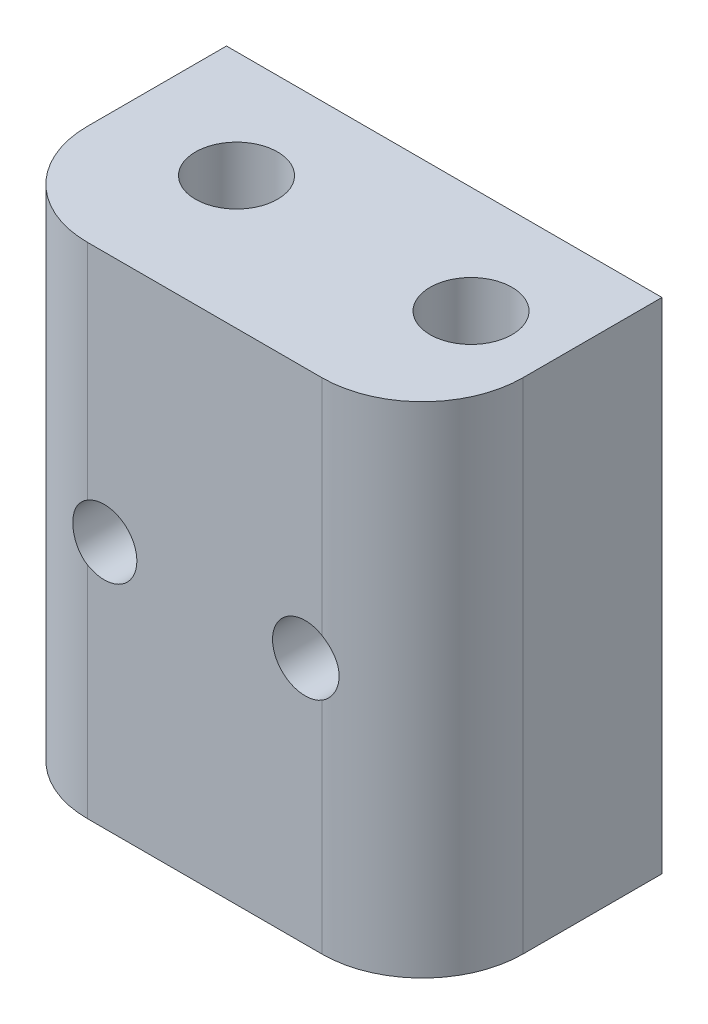
ISO-10303-21;
HEADER;
FILE_DESCRIPTION(('STEP AP214'),'2;1');
FILE_NAME('part.step','',(''),(''),'','','');
FILE_SCHEMA(('AUTOMOTIVE_DESIGN { 1 0 10303 214 1 1 1 1 }'));
ENDSEC;
DATA;
#1=APPLICATION_CONTEXT('core data for automotive mechanical design processes');
#2=APPLICATION_PROTOCOL_DEFINITION('international standard','automotive_design',2000,#1);
#3=PRODUCT_CONTEXT('',#1,'mechanical');
#4=PRODUCT('Part','Part','',(#3));
#5=PRODUCT_RELATED_PRODUCT_CATEGORY('part','',(#4));
#6=PRODUCT_DEFINITION_FORMATION('','',#4);
#7=PRODUCT_DEFINITION_CONTEXT('part definition',#1,'design');
#8=PRODUCT_DEFINITION('design','',#6,#7);
#9=PRODUCT_DEFINITION_SHAPE('','',#8);
#10=(LENGTH_UNIT() NAMED_UNIT(*) SI_UNIT(.MILLI.,.METRE.));
#11=(NAMED_UNIT(*) PLANE_ANGLE_UNIT() SI_UNIT($,.RADIAN.));
#12=(NAMED_UNIT(*) SI_UNIT($,.STERADIAN.) SOLID_ANGLE_UNIT());
#13=UNCERTAINTY_MEASURE_WITH_UNIT(LENGTH_MEASURE(1.E-05),#10,'distance_accuracy_value','');
#14=(GEOMETRIC_REPRESENTATION_CONTEXT(3) GLOBAL_UNCERTAINTY_ASSIGNED_CONTEXT((#13)) GLOBAL_UNIT_ASSIGNED_CONTEXT((#10,
#11,#12)) REPRESENTATION_CONTEXT('',''));
#15=CARTESIAN_POINT('',(0.,0.,0.));
#16=DIRECTION('',(0.,0.,1.));
#17=DIRECTION('',(1.,0.,0.));
#18=AXIS2_PLACEMENT_3D('',#15,#16,#17);
#19=CARTESIAN_POINT('',(-13.1453049350976,13.6204306214154,14.3));
#20=DIRECTION('',(1.,0.,0.));
#21=DIRECTION('',(0.,1.,0.));
#22=AXIS2_PLACEMENT_3D('',#19,#20,#21);
#23=PLANE('',#22);
#24=DIRECTION('',(0.,0.,-1.));
#25=VECTOR('',#24,1.);
#26=CARTESIAN_POINT('',(-13.1453049350976,-16.1795693785846,14.3));
#27=LINE('',#26,#25);
#28=CARTESIAN_POINT('',(-13.1453049350976,-16.1795693785846,8.3));
#29=VERTEX_POINT('',#28);
#30=CARTESIAN_POINT('',(-13.1453049350976,-16.1795693785846,0.));
#31=VERTEX_POINT('',#30);
#32=EDGE_CURVE('E118',#29,#31,#27,.T.);
#33=ORIENTED_EDGE('',*,*,#32,.F.);
#34=DIRECTION('',(0.,-1.,0.));
#35=VECTOR('',#34,1.);
#36=CARTESIAN_POINT('',(-13.1453049350976,13.6204306214154,8.3));
#37=LINE('',#36,#35);
#38=CARTESIAN_POINT('',(-13.1453049350976,13.6204306214154,8.3));
#39=VERTEX_POINT('',#38);
#40=EDGE_CURVE('E132',#29,#39,#37,.F.);
#41=ORIENTED_EDGE('',*,*,#40,.T.);
#42=DIRECTION('',(0.,0.,-1.));
#43=VECTOR('',#42,1.);
#44=CARTESIAN_POINT('',(-13.1453049350976,13.6204306214154,14.3));
#45=LINE('',#44,#43);
#46=CARTESIAN_POINT('',(-13.1453049350976,13.6204306214154,0.));
#47=VERTEX_POINT('',#46);
#48=EDGE_CURVE('E221',#39,#47,#45,.T.);
#49=ORIENTED_EDGE('',*,*,#48,.T.);
#50=DIRECTION('',(0.,-1.,0.));
#51=VECTOR('',#50,1.);
#52=CARTESIAN_POINT('',(-13.1453049350976,13.6204306214154,0.));
#53=LINE('',#52,#51);
#54=EDGE_CURVE('E212',#47,#31,#53,.T.);
#55=ORIENTED_EDGE('',*,*,#54,.T.);
#56=EDGE_LOOP('',(#33,#41,#49,#55));
#57=FACE_BOUND('',#56,.T.);
#58=ADVANCED_FACE('F30',(#57),#23,.F.);
#59=CARTESIAN_POINT('',(-13.1453049350976,-16.1795693785846,14.3));
#60=DIRECTION('',(0.,1.,0.));
#61=DIRECTION('',(0.,0.,1.));
#62=AXIS2_PLACEMENT_3D('',#59,#60,#61);
#63=PLANE('',#62);
#64=CARTESIAN_POINT('',(-6.14530493509756,-16.1795693785846,6.4));
#65=DIRECTION('',(0.,1.,0.));
#66=DIRECTION('',(0.,0.,1.));
#67=AXIS2_PLACEMENT_3D('',#64,#65,#66);
#68=CIRCLE('',#67,2.45);
#69=CARTESIAN_POINT('',(-6.14530493509756,-16.1795693785846,8.85));
#70=VERTEX_POINT('',#69);
#71=EDGE_CURVE('E164',#70,#70,#68,.T.);
#72=ORIENTED_EDGE('',*,*,#71,.T.);
#73=EDGE_LOOP('',(#72));
#74=FACE_BOUND('',#73,.T.);
#75=CARTESIAN_POINT('',(7.85469506492416,-16.1795693785846,6.40000020034491));
#76=DIRECTION('',(0.,1.,0.));
#77=DIRECTION('',(0.,0.,1.));
#78=AXIS2_PLACEMENT_3D('',#75,#76,#77);
#79=CIRCLE('',#78,2.45);
#80=CARTESIAN_POINT('',(7.85469506492416,-16.1795693785846,8.85000020034491));
#81=VERTEX_POINT('',#80);
#82=EDGE_CURVE('E206',#81,#81,#79,.T.);
#83=ORIENTED_EDGE('',*,*,#82,.T.);
#84=EDGE_LOOP('',(#83));
#85=FACE_BOUND('',#84,.T.);
#86=DIRECTION('',(1.,0.,0.));
#87=VECTOR('',#86,1.);
#88=CARTESIAN_POINT('',(-13.1453049350976,-16.1795693785846,14.3));
#89=LINE('',#88,#87);
#90=CARTESIAN_POINT('',(-7.14530493509755,-16.1795693785846,14.3));
#91=VERTEX_POINT('',#90);
#92=CARTESIAN_POINT('',(6.85469506490244,-16.1795693785846,14.3));
#93=VERTEX_POINT('',#92);
#94=EDGE_CURVE('E216',#91,#93,#89,.T.);
#95=ORIENTED_EDGE('',*,*,#94,.F.);
#96=CARTESIAN_POINT('',(-7.14530493509755,-16.1795693785846,8.3));
#97=DIRECTION('',(0.,1.,0.));
#98=DIRECTION('',(0.,0.,1.));
#99=AXIS2_PLACEMENT_3D('',#96,#97,#98);
#100=CIRCLE('',#99,6.);
#101=EDGE_CURVE('E130',#91,#29,#100,.F.);
#102=ORIENTED_EDGE('',*,*,#101,.T.);
#103=ORIENTED_EDGE('',*,*,#32,.T.);
#104=DIRECTION('',(1.,0.,0.));
#105=VECTOR('',#104,1.);
#106=CARTESIAN_POINT('',(-13.1453049350976,-16.1795693785846,0.));
#107=LINE('',#106,#105);
#108=CARTESIAN_POINT('',(12.8546950649024,-16.1795693785846,0.));
#109=VERTEX_POINT('',#108);
#110=EDGE_CURVE('E224',#31,#109,#107,.T.);
#111=ORIENTED_EDGE('',*,*,#110,.T.);
#112=DIRECTION('',(0.,0.,-1.));
#113=VECTOR('',#112,1.);
#114=CARTESIAN_POINT('',(12.8546950649024,-16.1795693785846,14.3));
#115=LINE('',#114,#113);
#116=CARTESIAN_POINT('',(12.8546950649024,-16.1795693785846,8.3));
#117=VERTEX_POINT('',#116);
#118=EDGE_CURVE('E121',#117,#109,#115,.T.);
#119=ORIENTED_EDGE('',*,*,#118,.F.);
#120=CARTESIAN_POINT('',(6.85469506490245,-16.1795693785846,8.3));
#121=DIRECTION('',(0.,1.,0.));
#122=DIRECTION('',(0.,0.,1.));
#123=AXIS2_PLACEMENT_3D('',#120,#121,#122);
#124=CIRCLE('',#123,6.);
#125=EDGE_CURVE('E128',#117,#93,#124,.F.);
#126=ORIENTED_EDGE('',*,*,#125,.T.);
#127=EDGE_LOOP('',(#95,#102,#103,#111,#119,#126));
#128=FACE_BOUND('',#127,.T.);
#129=ADVANCED_FACE('F174',(#74,#85,#128),#63,.F.);
#130=CARTESIAN_POINT('',(12.8546950649024,13.6204306214154,14.3));
#131=DIRECTION('',(-1.,0.,0.));
#132=DIRECTION('',(0.,-1.,0.));
#133=AXIS2_PLACEMENT_3D('',#130,#131,#132);
#134=PLANE('',#133);
#135=DIRECTION('',(0.,0.,-1.));
#136=VECTOR('',#135,1.);
#137=CARTESIAN_POINT('',(12.8546950649024,13.6204306214154,14.3));
#138=LINE('',#137,#136);
#139=CARTESIAN_POINT('',(12.8546950649024,13.6204306214154,8.3));
#140=VERTEX_POINT('',#139);
#141=CARTESIAN_POINT('',(12.8546950649024,13.6204306214154,0.));
#142=VERTEX_POINT('',#141);
#143=EDGE_CURVE('E233',#140,#142,#138,.T.);
#144=ORIENTED_EDGE('',*,*,#143,.F.);
#145=DIRECTION('',(0.,1.,0.));
#146=VECTOR('',#145,1.);
#147=CARTESIAN_POINT('',(12.8546950649024,-16.1795693785846,8.3));
#148=LINE('',#147,#146);
#149=EDGE_CURVE('E11',#140,#117,#148,.F.);
#150=ORIENTED_EDGE('',*,*,#149,.T.);
#151=ORIENTED_EDGE('',*,*,#118,.T.);
#152=DIRECTION('',(0.,1.,0.));
#153=VECTOR('',#152,1.);
#154=CARTESIAN_POINT('',(12.8546950649024,13.6204306214154,0.));
#155=LINE('',#154,#153);
#156=EDGE_CURVE('E227',#109,#142,#155,.T.);
#157=ORIENTED_EDGE('',*,*,#156,.T.);
#158=EDGE_LOOP('',(#144,#150,#151,#157));
#159=FACE_BOUND('',#158,.T.);
#160=ADVANCED_FACE('F178',(#159),#134,.F.);
#161=CARTESIAN_POINT('',(-13.1453049350976,13.6204306214154,14.3));
#162=DIRECTION('',(0.,-1.,0.));
#163=DIRECTION('',(0.,0.,-1.));
#164=AXIS2_PLACEMENT_3D('',#161,#162,#163);
#165=PLANE('',#164);
#166=CARTESIAN_POINT('',(-6.14530493509756,13.6204306214154,6.4));
#167=DIRECTION('',(0.,1.,0.));
#168=DIRECTION('',(0.,0.,1.));
#169=AXIS2_PLACEMENT_3D('',#166,#167,#168);
#170=CIRCLE('',#169,2.45);
#171=CARTESIAN_POINT('',(-6.14530493509756,13.6204306214154,8.85));
#172=VERTEX_POINT('',#171);
#173=EDGE_CURVE('E162',#172,#172,#170,.T.);
#174=ORIENTED_EDGE('',*,*,#173,.F.);
#175=EDGE_LOOP('',(#174));
#176=FACE_BOUND('',#175,.T.);
#177=CARTESIAN_POINT('',(7.85469506492416,13.6204306214154,6.40000020034491));
#178=DIRECTION('',(0.,1.,0.));
#179=DIRECTION('',(0.,0.,1.));
#180=AXIS2_PLACEMENT_3D('',#177,#178,#179);
#181=CIRCLE('',#180,2.45);
#182=CARTESIAN_POINT('',(7.85469506492416,13.6204306214154,8.85000020034491));
#183=VERTEX_POINT('',#182);
#184=EDGE_CURVE('E209',#183,#183,#181,.T.);
#185=ORIENTED_EDGE('',*,*,#184,.F.);
#186=EDGE_LOOP('',(#185));
#187=FACE_BOUND('',#186,.T.);
#188=ORIENTED_EDGE('',*,*,#48,.F.);
#189=CARTESIAN_POINT('',(-7.14530493509756,13.6204306214154,8.3));
#190=DIRECTION('',(0.,-1.,0.));
#191=DIRECTION('',(0.,0.,-1.));
#192=AXIS2_PLACEMENT_3D('',#189,#190,#191);
#193=CIRCLE('',#192,6.);
#194=CARTESIAN_POINT('',(-7.14530493509756,13.6204306214154,14.3));
#195=VERTEX_POINT('',#194);
#196=EDGE_CURVE('E44',#39,#195,#193,.F.);
#197=ORIENTED_EDGE('',*,*,#196,.T.);
#198=DIRECTION('',(-1.,0.,0.));
#199=VECTOR('',#198,1.);
#200=CARTESIAN_POINT('',(-13.1453049350976,13.6204306214154,14.3));
#201=LINE('',#200,#199);
#202=CARTESIAN_POINT('',(6.85469506490244,13.6204306214154,14.3));
#203=VERTEX_POINT('',#202);
#204=EDGE_CURVE('E218',#203,#195,#201,.T.);
#205=ORIENTED_EDGE('',*,*,#204,.F.);
#206=CARTESIAN_POINT('',(6.85469506490245,13.6204306214154,8.3));
#207=DIRECTION('',(0.,-1.,0.));
#208=DIRECTION('',(0.,0.,-1.));
#209=AXIS2_PLACEMENT_3D('',#206,#207,#208);
#210=CIRCLE('',#209,6.);
#211=EDGE_CURVE('E116',#203,#140,#210,.F.);
#212=ORIENTED_EDGE('',*,*,#211,.T.);
#213=ORIENTED_EDGE('',*,*,#143,.T.);
#214=DIRECTION('',(-1.,0.,0.));
#215=VECTOR('',#214,1.);
#216=CARTESIAN_POINT('',(-13.1453049350976,13.6204306214154,0.));
#217=LINE('',#216,#215);
#218=EDGE_CURVE('E219',#142,#47,#217,.T.);
#219=ORIENTED_EDGE('',*,*,#218,.T.);
#220=EDGE_LOOP('',(#188,#197,#205,#212,#213,#219));
#221=FACE_BOUND('',#220,.T.);
#222=ADVANCED_FACE('F182',(#176,#187,#221),#165,.F.);
#223=CARTESIAN_POINT('',(-13.1453049350976,-16.1795693785846,14.3));
#224=DIRECTION('',(0.,0.,1.));
#225=DIRECTION('',(1.,0.,0.));
#226=AXIS2_PLACEMENT_3D('',#223,#224,#225);
#227=PLANE('',#226);
#228=CARTESIAN_POINT('',(5.85469506490245,-1.37956937858462,14.3));
#229=DIRECTION('',(0.,0.,1.));
#230=DIRECTION('',(1.,0.,0.));
#231=AXIS2_PLACEMENT_3D('',#228,#229,#230);
#232=CIRCLE('',#231,1.95);
#233=CARTESIAN_POINT('',(6.85469506490245,0.294497525693705,14.3));
#234=VERTEX_POINT('',#233);
#235=CARTESIAN_POINT('',(6.85469506490245,-3.05363628286294,14.3));
#236=VERTEX_POINT('',#235);
#237=EDGE_CURVE('E51',#234,#236,#232,.T.);
#238=ORIENTED_EDGE('',*,*,#237,.F.);
#239=DIRECTION('',(0.,1.,0.));
#240=VECTOR('',#239,1.);
#241=CARTESIAN_POINT('',(6.85469506490245,13.6204306214154,14.3));
#242=LINE('',#241,#240);
#243=EDGE_CURVE('E109',#234,#203,#242,.T.);
#244=ORIENTED_EDGE('',*,*,#243,.T.);
#245=ORIENTED_EDGE('',*,*,#204,.T.);
#246=DIRECTION('',(0.,-1.,0.));
#247=VECTOR('',#246,1.);
#248=CARTESIAN_POINT('',(-7.14530493509755,-16.1795693785846,14.3));
#249=LINE('',#248,#247);
#250=CARTESIAN_POINT('',(-7.14530493509755,0.294497525693705,14.3));
#251=VERTEX_POINT('',#250);
#252=EDGE_CURVE('E125',#195,#251,#249,.T.);
#253=ORIENTED_EDGE('',*,*,#252,.T.);
#254=CARTESIAN_POINT('',(-6.14530493509755,-1.37956937858462,14.3));
#255=DIRECTION('',(0.,0.,1.));
#256=DIRECTION('',(1.,0.,0.));
#257=AXIS2_PLACEMENT_3D('',#254,#255,#256);
#258=CIRCLE('',#257,1.95);
#259=CARTESIAN_POINT('',(-7.14530493509755,-3.05363628286294,14.3));
#260=VERTEX_POINT('',#259);
#261=EDGE_CURVE('E58',#260,#251,#258,.T.);
#262=ORIENTED_EDGE('',*,*,#261,.F.);
#263=EDGE_CURVE('E120',#260,#91,#249,.T.);
#264=ORIENTED_EDGE('',*,*,#263,.T.);
#265=ORIENTED_EDGE('',*,*,#94,.T.);
#266=EDGE_CURVE('E112',#93,#236,#242,.T.);
#267=ORIENTED_EDGE('',*,*,#266,.T.);
#268=EDGE_LOOP('',(#238,#244,#245,#253,#262,#264,#265,#267));
#269=FACE_BOUND('',#268,.T.);
#270=ADVANCED_FACE('F107',(#269),#227,.T.);
#271=CARTESIAN_POINT('',(-13.1453049350976,-16.1795693785846,0.));
#272=DIRECTION('',(0.,0.,1.));
#273=DIRECTION('',(1.,0.,0.));
#274=AXIS2_PLACEMENT_3D('',#271,#272,#273);
#275=PLANE('',#274);
#276=CARTESIAN_POINT('',(5.85469506490245,-1.37956937858462,0.));
#277=DIRECTION('',(0.,0.,1.));
#278=DIRECTION('',(1.,0.,0.));
#279=AXIS2_PLACEMENT_3D('',#276,#277,#278);
#280=CIRCLE('',#279,1.95);
#281=CARTESIAN_POINT('',(7.80469506490245,-1.37956937858462,0.));
#282=VERTEX_POINT('',#281);
#283=EDGE_CURVE('E113',#282,#282,#280,.T.);
#284=ORIENTED_EDGE('',*,*,#283,.T.);
#285=EDGE_LOOP('',(#284));
#286=FACE_BOUND('',#285,.T.);
#287=CARTESIAN_POINT('',(-6.14530493509755,-1.37956937858462,0.));
#288=DIRECTION('',(0.,0.,1.));
#289=DIRECTION('',(1.,0.,0.));
#290=AXIS2_PLACEMENT_3D('',#287,#288,#289);
#291=CIRCLE('',#290,1.95);
#292=CARTESIAN_POINT('',(-4.19530493509755,-1.37956937858462,0.));
#293=VERTEX_POINT('',#292);
#294=EDGE_CURVE('E143',#293,#293,#291,.T.);
#295=ORIENTED_EDGE('',*,*,#294,.T.);
#296=EDGE_LOOP('',(#295));
#297=FACE_BOUND('',#296,.T.);
#298=ORIENTED_EDGE('',*,*,#54,.F.);
#299=ORIENTED_EDGE('',*,*,#218,.F.);
#300=ORIENTED_EDGE('',*,*,#156,.F.);
#301=ORIENTED_EDGE('',*,*,#110,.F.);
#302=EDGE_LOOP('',(#298,#299,#300,#301));
#303=FACE_BOUND('',#302,.T.);
#304=ADVANCED_FACE('F170',(#286,#297,#303),#275,.F.);
#305=CARTESIAN_POINT('',(-7.14530493509755,-16.1795693785846,8.3));
#306=DIRECTION('',(0.,1.,0.));
#307=DIRECTION('',(-1.,0.,0.));
#308=AXIS2_PLACEMENT_3D('',#305,#306,#307);
#309=CYLINDRICAL_SURFACE('',#308,6.);
#310=CARTESIAN_POINT('',(-7.14530493509755,0.294497525693705,14.3));
#311=CARTESIAN_POINT('',(-7.1921696200533,0.266503410643053,14.3000018072945));
#312=CARTESIAN_POINT('',(-7.23783240159849,0.236554786161152,14.2994506606315));
#313=CARTESIAN_POINT('',(-7.32646750732688,0.172955002499119,14.2974278403165));
#314=CARTESIAN_POINT('',(-7.36944036393878,0.13930457969142,14.2959563494702));
#315=CARTESIAN_POINT('',(-7.49375747901827,0.0332322869272666,14.2904462090898));
#316=CARTESIAN_POINT('',(-7.57068769072364,-0.0444228691703343,14.2853104289395));
#317=CARTESIAN_POINT('',(-7.71043908720387,-0.211356420944899,14.2737395438166));
#318=CARTESIAN_POINT('',(-7.77326158036889,-0.300633737535304,14.2673045594413));
#319=CARTESIAN_POINT('',(-7.88317621599532,-0.488428277006108,14.2547134776081));
#320=CARTESIAN_POINT('',(-7.93026878522521,-0.586945249112567,14.248557372588));
#321=CARTESIAN_POINT('',(-8.00774141398552,-0.791443063271864,14.237824436147));
#322=CARTESIAN_POINT('',(-8.03796859196359,-0.897482663576686,14.2332621873414));
#323=CARTESIAN_POINT('',(-8.080153387135,-1.11322369441396,14.2267630866548));
#324=CARTESIAN_POINT('',(-8.09211071287886,-1.22292518333409,14.2248262766561));
#325=CARTESIAN_POINT('',(-8.09735201427701,-1.44162115449943,14.223986230863));
#326=CARTESIAN_POINT('',(-8.09083198083293,-1.55061085783406,14.2250511547799));
#327=CARTESIAN_POINT('',(-8.05974312194822,-1.76590425634346,14.2299279398784));
#328=CARTESIAN_POINT('',(-8.03517648909521,-1.87220827619492,14.2337394673579));
#329=CARTESIAN_POINT('',(-7.96881384183982,-2.07890598764608,14.24331098493));
#330=CARTESIAN_POINT('',(-7.92705981276687,-2.17931340519351,14.2490662208279));
#331=CARTESIAN_POINT('',(-7.82746326327631,-2.37183687656617,14.2613056503569));
#332=CARTESIAN_POINT('',(-7.76961042411703,-2.46394756220229,14.2677903099281));
#333=CARTESIAN_POINT('',(-7.63855494668526,-2.63844745818186,14.2800576282276));
#334=CARTESIAN_POINT('',(-7.56516269146031,-2.7206948567819,14.2858300746759));
#335=CARTESIAN_POINT('',(-7.40561601259518,-2.87158618932355,14.2948781931312));
#336=CARTESIAN_POINT('',(-7.31949255469582,-2.94026221100645,14.2981598079173));
#337=CARTESIAN_POINT('',(-7.20108121598344,-3.01936277001372,14.2998038733818));
#338=CARTESIAN_POINT('',(-7.17340013343576,-3.03686026905435,14.3000021848381));
#339=CARTESIAN_POINT('',(-7.14530493509755,-3.05363628286294,14.3));
#340=B_SPLINE_CURVE_WITH_KNOTS('',3,(#310,#311,#312,#313,#314,#315,#316,#317,#318,#319,#320,
#321,#322,#323,#324,#325,#326,#327,#328,#329,#330,#331,#332,#333,#334,#335,#336,#337,#338,#339),
.UNSPECIFIED.,.F.,.F.,(4,2,2,2,2,2,2,2,2,2,2,2,2,2,4),(0.,0.163659727948247,0.327286958898937,
0.653894539156658,0.980471816372283,1.30704023250181,1.63652273621455,1.96601049593618,
2.29201647292962,2.61798284808707,2.94315763472363,3.26854132836156,3.59815140736063,
3.92697258881414,4.02517034280819),.UNSPECIFIED.);
#341=EDGE_CURVE('E156',#251,#260,#340,.T.);
#342=ORIENTED_EDGE('',*,*,#341,.F.);
#343=ORIENTED_EDGE('',*,*,#252,.F.);
#344=ORIENTED_EDGE('',*,*,#196,.F.);
#345=ORIENTED_EDGE('',*,*,#40,.F.);
#346=ORIENTED_EDGE('',*,*,#101,.F.);
#347=ORIENTED_EDGE('',*,*,#263,.F.);
#348=EDGE_LOOP('',(#342,#343,#344,#345,#346,#347));
#349=FACE_BOUND('',#348,.T.);
#350=ADVANCED_FACE('F166',(#349),#309,.T.);
#351=CARTESIAN_POINT('',(6.85469506490245,-16.1795693785846,8.3));
#352=DIRECTION('',(0.,-1.,0.));
#353=DIRECTION('',(1.,0.,0.));
#354=AXIS2_PLACEMENT_3D('',#351,#352,#353);
#355=CYLINDRICAL_SURFACE('',#354,6.);
#356=CARTESIAN_POINT('',(6.85469506490244,-3.05363628286294,14.3));
#357=CARTESIAN_POINT('',(6.90155974985819,-3.02564216781229,14.3000018072945));
#358=CARTESIAN_POINT('',(6.94722253140338,-2.99569354333039,14.2994506606315));
#359=CARTESIAN_POINT('',(7.03585763713177,-2.93209375966836,14.2974278403165));
#360=CARTESIAN_POINT('',(7.07883049374366,-2.89844333686066,14.2959563494702));
#361=CARTESIAN_POINT('',(7.20314760882316,-2.7923710440965,14.2904462090898));
#362=CARTESIAN_POINT('',(7.28007782052853,-2.7147158879989,14.2853104289395));
#363=CARTESIAN_POINT('',(7.41982921700876,-2.54778233622434,14.2737395438166));
#364=CARTESIAN_POINT('',(7.48265171017378,-2.45850501963393,14.2673045594413));
#365=CARTESIAN_POINT('',(7.59256634580021,-2.27071048016313,14.2547134776081));
#366=CARTESIAN_POINT('',(7.6396589150301,-2.17219350805667,14.248557372588));
#367=CARTESIAN_POINT('',(7.71713154379041,-1.96769569389738,14.237824436147));
#368=CARTESIAN_POINT('',(7.74735872176848,-1.86165609359255,14.2332621873414));
#369=CARTESIAN_POINT('',(7.78954351693989,-1.64591506275528,14.2267630866548));
#370=CARTESIAN_POINT('',(7.80150084268375,-1.53621357383515,14.2248262766561));
#371=CARTESIAN_POINT('',(7.8067421440819,-1.31751760266981,14.223986230863));
#372=CARTESIAN_POINT('',(7.80022211063782,-1.20852789933518,14.2250511547799));
#373=CARTESIAN_POINT('',(7.76913325175311,-0.993234500825779,14.2299279398784));
#374=CARTESIAN_POINT('',(7.7445666189001,-0.886930480974322,14.2337394673579));
#375=CARTESIAN_POINT('',(7.67820397164472,-0.680232769523159,14.24331098493));
#376=CARTESIAN_POINT('',(7.63644994257177,-0.579825351975727,14.2490662208279));
#377=CARTESIAN_POINT('',(7.5368533930812,-0.387301880603075,14.2613056503569));
#378=CARTESIAN_POINT('',(7.47900055392192,-0.29519119496695,14.2677903099281));
#379=CARTESIAN_POINT('',(7.34794507649016,-0.120691298987373,14.2800576282276));
#380=CARTESIAN_POINT('',(7.27455282126521,-0.0384439003873347,14.2858300746759));
#381=CARTESIAN_POINT('',(7.11500614240008,0.112447432154316,14.2948781931312));
#382=CARTESIAN_POINT('',(7.02888268450072,0.181123453837215,14.2981598079173));
#383=CARTESIAN_POINT('',(6.91047134578834,0.260224012844482,14.2998038733818));
#384=CARTESIAN_POINT('',(6.88279026324065,0.277721511885115,14.3000021848381));
#385=CARTESIAN_POINT('',(6.85469506490244,0.294497525693709,14.3));
#386=B_SPLINE_CURVE_WITH_KNOTS('',3,(#356,#357,#358,#359,#360,#361,#362,#363,#364,#365,#366,
#367,#368,#369,#370,#371,#372,#373,#374,#375,#376,#377,#378,#379,#380,#381,#382,#383,#384,#385),
.UNSPECIFIED.,.F.,.F.,(4,2,2,2,2,2,2,2,2,2,2,2,2,2,4),(0.,0.163659727948246,0.327286958898938,
0.653894539156657,0.980471816372282,1.3070402325018,1.63652273621455,1.96601049593618,
2.29201647292962,2.61798284808707,2.94315763472362,3.26854132836155,3.59815140736063,
3.92697258881414,4.0251703428082),.UNSPECIFIED.);
#387=EDGE_CURVE('E98',#236,#234,#386,.T.);
#388=ORIENTED_EDGE('',*,*,#387,.F.);
#389=ORIENTED_EDGE('',*,*,#266,.F.);
#390=ORIENTED_EDGE('',*,*,#125,.F.);
#391=ORIENTED_EDGE('',*,*,#149,.F.);
#392=ORIENTED_EDGE('',*,*,#211,.F.);
#393=ORIENTED_EDGE('',*,*,#243,.F.);
#394=EDGE_LOOP('',(#388,#389,#390,#391,#392,#393));
#395=FACE_BOUND('',#394,.T.);
#396=ADVANCED_FACE('F32',(#395),#355,.T.);
#397=CARTESIAN_POINT('',(7.85469506492416,-16.1795693785846,6.40000020034491));
#398=DIRECTION('',(0.,1.,0.));
#399=DIRECTION('',(0.,0.,1.));
#400=AXIS2_PLACEMENT_3D('',#397,#398,#399);
#401=CYLINDRICAL_SURFACE('',#400,2.45);
#402=CARTESIAN_POINT('',(7.80469506490245,-1.37956937858462,3.95051045756217));
#403=CARTESIAN_POINT('',(7.80469016317818,-1.48827160937784,3.9505040545337));
#404=CARTESIAN_POINT('',(7.79557577565852,-1.59705068663046,3.95064395620171));
#405=CARTESIAN_POINT('',(7.75933675653578,-1.81167063267924,3.9517920867124));
#406=CARTESIAN_POINT('',(7.73218849646207,-1.9175074566615,3.95280145526984));
#407=CARTESIAN_POINT('',(7.6606185728202,-2.12320831558885,3.95743666479562));
#408=CARTESIAN_POINT('',(7.61618668029895,-2.22306877308974,3.96106405627507));
#409=CARTESIAN_POINT('',(7.51145078659348,-2.41372414619035,3.97359320635631));
#410=CARTESIAN_POINT('',(7.45115346891539,-2.50452285699923,3.98249274597164));
#411=CARTESIAN_POINT('',(7.31882171206404,-2.67181020940143,4.00840130357582));
#412=CARTESIAN_POINT('',(7.24715452382028,-2.74862301767936,4.02518122041022));
#413=CARTESIAN_POINT('',(7.09433531462095,-2.88837104767578,4.069625362282));
#414=CARTESIAN_POINT('',(7.01319308959323,-2.95132041133728,4.09727841477162));
#415=CARTESIAN_POINT('',(6.85372709610153,-3.05668677362242,4.16230629514479));
#416=CARTESIAN_POINT('',(6.77583553282744,-3.10046341222371,4.19854690915801));
#417=CARTESIAN_POINT('',(6.61987752532819,-3.17525251335298,4.28209029682505));
#418=CARTESIAN_POINT('',(6.54181107977092,-3.20626487831901,4.32939315502726));
#419=CARTESIAN_POINT('',(6.39129154606681,-3.25591748363389,4.43300474725705));
#420=CARTESIAN_POINT('',(6.31874226285161,-3.27488177983245,4.4890220916181));
#421=CARTESIAN_POINT('',(6.17944406809526,-3.30365491030616,4.60987439652999));
#422=CARTESIAN_POINT('',(6.11269740244176,-3.31346021379995,4.67471274654291));
#423=CARTESIAN_POINT('',(5.97874135168623,-3.32692903378007,4.82065935012479));
#424=CARTESIAN_POINT('',(5.91255478931288,-3.32965176231864,4.90278803702953));
#425=CARTESIAN_POINT('',(5.79128830385292,-3.32948305162056,5.0748741534468));
#426=CARTESIAN_POINT('',(5.7362174023958,-3.32658707222726,5.16483785788415));
#427=CARTESIAN_POINT('',(5.6282933758587,-3.31728578592294,5.36966768327731));
#428=CARTESIAN_POINT('',(5.57809676024449,-3.31029347304888,5.48591110303434));
#429=CARTESIAN_POINT('',(5.49618033951532,-3.29678388169471,5.72483563892085));
#430=CARTESIAN_POINT('',(5.4644655879771,-3.29026673356677,5.84751850582983));
#431=CARTESIAN_POINT('',(5.43034360709421,-3.2828716808949,6.03974738162183));
#432=CARTESIAN_POINT('',(5.4211674923126,-3.28077695419724,6.10810862578674));
#433=CARTESIAN_POINT('',(5.40860664447391,-3.27787173271757,6.24540800177586));
#434=CARTESIAN_POINT('',(5.40522224991422,-3.27706131299715,6.31434616708166));
#435=CARTESIAN_POINT('',(5.40428172325226,-3.27683763493227,6.45225286789412));
#436=CARTESIAN_POINT('',(5.40672490329154,-3.27742421169315,6.52122139885584));
#437=CARTESIAN_POINT('',(5.41741451051837,-3.27991558944641,6.65868088581347));
#438=CARTESIAN_POINT('',(5.42566080496067,-3.2818203602853,6.72717185269738));
#439=CARTESIAN_POINT('',(5.44761467344981,-3.28663754273111,6.86149705743158));
#440=CARTESIAN_POINT('',(5.46118220558548,-3.28952388150389,6.92735511627972));
#441=CARTESIAN_POINT('',(5.49367171188228,-3.29592838900101,7.05771296524497));
#442=CARTESIAN_POINT('',(5.51259550422059,-3.29944677212377,7.12221228613824));
#443=CARTESIAN_POINT('',(5.5772514523523,-3.31023426935761,7.3131235769223));
#444=CARTESIAN_POINT('',(5.63086675507147,-3.31773530743173,7.4369402208653));
#445=CARTESIAN_POINT('',(5.75961391041826,-3.32834290962288,7.67758663459924));
#446=CARTESIAN_POINT('',(5.83529545990565,-3.33132333133345,7.79413171411331));
#447=CARTESIAN_POINT('',(5.96249041055602,-3.3270470296585,7.95783477435574));
#448=CARTESIAN_POINT('',(6.00714321578546,-3.32416719108803,8.01052779447369));
#449=CARTESIAN_POINT('',(6.10053000849944,-3.31458115678265,8.11176629209426));
#450=CARTESIAN_POINT('',(6.14926209437871,-3.30787673554001,8.16031368104492));
#451=CARTESIAN_POINT('',(6.27147721148412,-3.28589912219455,8.27226027661643));
#452=CARTESIAN_POINT('',(6.34673866934078,-3.26820598731515,8.3333004833112));
#453=CARTESIAN_POINT('',(6.50139599912793,-3.22098114793517,8.4445406876806));
#454=CARTESIAN_POINT('',(6.58078803979846,-3.19146024957962,8.49475051602372));
#455=CARTESIAN_POINT('',(6.74035432301952,-3.11905215078386,8.58383291185946));
#456=CARTESIAN_POINT('',(6.82053039791245,-3.0761141069289,8.62266124661462));
#457=CARTESIAN_POINT('',(6.97716380852925,-2.97680455818933,8.68903713850839));
#458=CARTESIAN_POINT('',(7.05362038552215,-2.92043032621131,8.71658240247428));
#459=CARTESIAN_POINT('',(7.19467861767146,-2.79910909488927,8.76051437746291));
#460=CARTESIAN_POINT('',(7.25971342417034,-2.73486335646201,8.77746315739191));
#461=CARTESIAN_POINT('',(7.38068202701247,-2.59705751536698,8.80450863457686));
#462=CARTESIAN_POINT('',(7.43661350067958,-2.52349504406153,8.81460358518493));
#463=CARTESIAN_POINT('',(7.5409400068545,-2.36382230250252,8.83043834507541));
#464=CARTESIAN_POINT('',(7.58861093738671,-2.27720764711539,8.83585321425349));
#465=CARTESIAN_POINT('',(7.6703512742904,-2.09764706375873,8.8434006844442));
#466=CARTESIAN_POINT('',(7.70441581303676,-2.00469888389462,8.84553211159789));
#467=CARTESIAN_POINT('',(7.76031785669691,-1.80679953045864,8.84835735230784));
#468=CARTESIAN_POINT('',(7.78090784984481,-1.70149204576758,8.84891736117953));
#469=CARTESIAN_POINT('',(7.80456286971552,-1.4889230303542,8.84951584971942));
#470=CARTESIAN_POINT('',(7.80762543849243,-1.38166122768518,8.84955425624213));
#471=CARTESIAN_POINT('',(7.79600118774533,-1.16551406195427,8.84930460476452));
#472=CARTESIAN_POINT('',(7.78088736005282,-1.05665137043388,8.84900870309062));
#473=CARTESIAN_POINT('',(7.73261304158141,-0.842984599884023,8.84707454197378));
#474=CARTESIAN_POINT('',(7.69944816060736,-0.73818151483583,8.84543595592768));
#475=CARTESIAN_POINT('',(7.61610358476153,-0.535831512649243,8.83871138664881));
#476=CARTESIAN_POINT('',(7.56594679200524,-0.438275043011217,8.83363003449083));
#477=CARTESIAN_POINT('',(7.45028733522446,-0.253308928400414,8.81709554697236));
#478=CARTESIAN_POINT('',(7.38479128949067,-0.165894931601254,8.80564515668252));
#479=CARTESIAN_POINT('',(7.24438325947315,-0.0077298821657707,8.77380568425703));
#480=CARTESIAN_POINT('',(7.17001858644592,0.0635887551118041,8.75383613608078));
#481=CARTESIAN_POINT('',(7.01344655484112,0.192061515096244,8.70250971980026));
#482=CARTESIAN_POINT('',(6.93124701195589,0.249229553122244,8.67116411403569));
#483=CARTESIAN_POINT('',(6.77152893664733,0.343719278381834,8.59913522914317));
#484=CARTESIAN_POINT('',(6.69428975380124,0.382395461905391,8.55959679832971));
#485=CARTESIAN_POINT('',(6.54090138112294,0.447606526910862,8.46986448198991));
#486=CARTESIAN_POINT('',(6.46475237306077,0.474139406004163,8.41966884112301));
#487=CARTESIAN_POINT('',(6.31703245400055,0.516384433086188,8.30959704056693));
#488=CARTESIAN_POINT('',(6.24544808414838,0.532129866584724,8.24975136932602));
#489=CARTESIAN_POINT('',(6.10892271896318,0.555028289799112,8.12150165886356));
#490=CARTESIAN_POINT('',(6.0439844839175,0.562177722547527,8.05309408970424));
#491=CARTESIAN_POINT('',(5.9131841240646,0.570815451965627,7.89826033587974));
#492=CARTESIAN_POINT('',(5.84863879231677,0.571296129737498,7.81066976134287));
#493=CARTESIAN_POINT('',(5.7317519231221,0.567431088276451,7.6277703062974));
#494=CARTESIAN_POINT('',(5.67942104645625,0.563081171820796,7.53245478046148));
#495=CARTESIAN_POINT('',(5.57891408371036,0.551619863933241,7.31658349994153));
#496=CARTESIAN_POINT('',(5.53354504922392,0.544135088105499,7.19473367279068));
#497=CARTESIAN_POINT('',(5.46262292423095,0.530955433550126,6.94524318417809));
#498=CARTESIAN_POINT('',(5.43707052112624,0.525260616916901,6.81760232199876));
#499=CARTESIAN_POINT('',(5.4136609297428,0.519913760904359,6.62045786099571));
#500=CARTESIAN_POINT('',(5.40843313333444,0.518679904748813,6.55179851741181));
#501=CARTESIAN_POINT('',(5.40377141628335,0.517580926543868,6.41425426144202));
#502=CARTESIAN_POINT('',(5.40433776573516,0.51771586830108,6.34536933869036));
#503=CARTESIAN_POINT('',(5.41126729604069,0.519347193749857,6.20791724504455));
#504=CARTESIAN_POINT('',(5.41762976429306,0.520843410080071,6.13935003613073));
#505=CARTESIAN_POINT('',(5.43609160813689,0.524992336623807,6.00301754745663));
#506=CARTESIAN_POINT('',(5.44819314505064,0.527645482504455,5.93525257968153));
#507=CARTESIAN_POINT('',(5.49231523756606,0.536705128037746,5.73689361520664));
#508=CARTESIAN_POINT('',(5.53232402820849,0.544277365184313,5.6080495054915));
#509=CARTESIAN_POINT('',(5.6330201482398,0.558450518019482,5.35847158438107));
#510=CARTESIAN_POINT('',(5.69372871530859,0.56505042611299,5.23774625565092));
#511=CARTESIAN_POINT('',(5.79998116129818,0.569994654668781,5.06379356277921));
#512=CARTESIAN_POINT('',(5.83854432970043,0.570792806313331,5.00629025158871));
#513=CARTESIAN_POINT('',(5.92037686213272,0.569753894805331,4.89478014339275));
#514=CARTESIAN_POINT('',(5.96364346841157,0.567918368228442,4.84077132679157));
#515=CARTESIAN_POINT('',(6.05437827829295,0.560711713616706,4.73683873600163));
#516=CARTESIAN_POINT('',(6.10183753673283,0.555347962656392,4.68690668215724));
#517=CARTESIAN_POINT('',(6.20039201100726,0.540191142943871,4.59155190224531));
#518=CARTESIAN_POINT('',(6.25148530597717,0.530400399745579,4.54612682386606));
#519=CARTESIAN_POINT('',(6.37698970847029,0.500673820355629,4.44354027533944));
#520=CARTESIAN_POINT('',(6.45274530698953,0.478273912981738,4.38867942869965));
#521=CARTESIAN_POINT('',(6.60668840596233,0.421464526611615,4.28970345151686));
#522=CARTESIAN_POINT('',(6.6848740860836,0.387063848675031,4.24558048623174));
#523=CARTESIAN_POINT('',(6.84018585539093,0.305368505253931,4.16822547226445));
#524=CARTESIAN_POINT('',(6.91730910742629,0.258044486884026,4.13501860043982));
#525=CARTESIAN_POINT('',(7.06649284039248,0.150947258862639,4.07887828677454));
#526=CARTESIAN_POINT('',(7.13855176915077,0.0911702545368505,4.05594798313741));
#527=CARTESIAN_POINT('',(7.27225051743653,-0.0374136816143751,4.01925894025035));
#528=CARTESIAN_POINT('',(7.33414255779365,-0.105886485118801,4.00523989704057));
#529=CARTESIAN_POINT('',(7.44798841599019,-0.251531281968159,3.98329602118808));
#530=CARTESIAN_POINT('',(7.49993707387379,-0.32870775910881,3.97537434626784));
#531=CARTESIAN_POINT('',(7.59613275689051,-0.496404855717975,3.9631598490298));
#532=CARTESIAN_POINT('',(7.63942086090868,-0.587499685632594,3.95921118554762));
#533=CARTESIAN_POINT('',(7.71142063990183,-0.77527525025714,3.95392489673649));
#534=CARTESIAN_POINT('',(7.74014315305518,-0.871951771818036,3.95258532787939));
#535=CARTESIAN_POINT('',(7.77567862267666,-1.03743439105768,3.95123433832549));
#536=CARTESIAN_POINT('',(7.78654667843209,-1.10539562718699,3.9509370131116));
#537=CARTESIAN_POINT('',(7.80105655117956,-1.24208410533072,3.950577094508));
#538=CARTESIAN_POINT('',(7.8046981654166,-1.31081136878346,3.95051450770439));
#539=CARTESIAN_POINT('',(7.80469506490245,-1.37956937858462,3.95051045756217));
#540=B_SPLINE_CURVE_WITH_KNOTS('',3,(#402,#403,#404,#405,#406,#407,#408,#409,#410,#411,#412,
#413,#414,#415,#416,#417,#418,#419,#420,#421,#422,#423,#424,#425,#426,#427,#428,#429,#430,#431,
#432,#433,#434,#435,#436,#437,#438,#439,#440,#441,#442,#443,#444,#445,#446,#447,#448,#449,#450,
#451,#452,#453,#454,#455,#456,#457,#458,#459,#460,#461,#462,#463,#464,#465,#466,#467,#468,#469,
#470,#471,#472,#473,#474,#475,#476,#477,#478,#479,#480,#481,#482,#483,#484,#485,#486,#487,#488,
#489,#490,#491,#492,#493,#494,#495,#496,#497,#498,#499,#500,#501,#502,#503,#504,#505,#506,#507,
#508,#509,#510,#511,#512,#513,#514,#515,#516,#517,#518,#519,#520,#521,#522,#523,#524,#525,#526,
#527,#528,#529,#530,#531,#532,#533,#534,#535,#536,#537,#538,#539),.UNSPECIFIED.,.T.,.F.,(4,2,2,
2,2,2,2,2,2,2,2,2,2,2,2,2,2,2,2,2,2,2,2,2,2,2,2,2,2,2,2,2,2,2,2,2,2,2,2,2,2,2,2,2,2,2,2,2,2,2,2,
2,2,2,2,2,2,2,2,2,2,2,2,2,2,2,2,2,4),(0.,0.32586110540244,0.652150007248744,0.978632310819293,
1.30497729927761,1.62237208308082,1.93944158076249,2.22721756165835,2.51499574208942,
2.79466333979691,3.07443870460734,3.38983079073851,3.70547783332587,4.08438588217757,
4.46339748895556,4.67019483939543,4.87700427570417,5.0837893024447,5.2905695991673,
5.49223828882473,5.69397551698496,6.09747599405772,6.51204097703963,6.71912818332794,
6.92611938538598,7.2203097480015,7.51423194150963,7.80928172516877,8.10439144506523,
8.38210463998605,8.6598885815284,8.95568949153396,9.25159612840263,9.57202986926986,
9.89250854483403,10.2206654356912,10.5489021732445,10.8766982538498,11.2043531629128,
11.5174574557608,11.8302526159951,12.1138478553934,12.3974898418253,12.6802526385973,
12.9631324004934,13.2883566301672,13.6138636630012,14.0029370839628,14.3920240005489,
14.5984106991329,14.8048070184916,15.011177965967,15.2176266941388,15.6210734655908,
16.0249354195485,16.2324133915198,16.4397703631362,16.6466951496102,16.8535113619872,
17.1407116746883,17.4277018032468,17.715349275626,18.0030845285003,18.2819733907751,
18.5610065878112,18.8625418759363,19.1638524628253,19.3699653668639,19.5760840538088),.UNSPECIFIED.);
#541=CARTESIAN_POINT('',(7.80469506490245,-1.37956937858462,3.95051045756217));
#542=VERTEX_POINT('',#541);
#543=EDGE_CURVE('E35',#542,#542,#540,.T.);
#544=ORIENTED_EDGE('',*,*,#543,.T.);
#545=EDGE_LOOP('',(#544));
#546=FACE_BOUND('',#545,.T.);
#547=ORIENTED_EDGE('',*,*,#82,.F.);
#548=EDGE_LOOP('',(#547));
#549=FACE_BOUND('',#548,.T.);
#550=ORIENTED_EDGE('',*,*,#184,.T.);
#551=EDGE_LOOP('',(#550));
#552=FACE_BOUND('',#551,.T.);
#553=ADVANCED_FACE('F191',(#546,#549,#552),#401,.F.);
#554=CARTESIAN_POINT('',(-6.14530493509756,-16.1795693785846,6.4));
#555=DIRECTION('',(0.,1.,0.));
#556=DIRECTION('',(0.,0.,1.));
#557=AXIS2_PLACEMENT_3D('',#554,#555,#556);
#558=CYLINDRICAL_SURFACE('',#557,2.45);
#559=CARTESIAN_POINT('',(-6.14530493509756,-3.32956937858462,8.85));
#560=CARTESIAN_POINT('',(-6.05154198194233,-3.32956147264567,8.84999232795398));
#561=CARTESIAN_POINT('',(-5.95766889634895,-3.32275228083281,8.84456341061618));
#562=CARTESIAN_POINT('',(-5.77295573238411,-3.29597410427024,8.82333312395694));
#563=CARTESIAN_POINT('',(-5.6821215399379,-3.27598097764231,8.80751272639362));
#564=CARTESIAN_POINT('',(-5.50663824982531,-3.22427080671578,8.76699527708853));
#565=CARTESIAN_POINT('',(-5.42195457080646,-3.19262657015003,8.74235337682736));
#566=CARTESIAN_POINT('',(-5.25975178218965,-3.11917730987407,8.68597563873108));
#567=CARTESIAN_POINT('',(-5.18223338367208,-3.0773712792014,8.65423909789193));
#568=CARTESIAN_POINT('',(-5.00969409005102,-2.9690818722227,8.57366251227198));
#569=CARTESIAN_POINT('',(-4.91788218867878,-2.8990631865984,8.52270196926845));
#570=CARTESIAN_POINT('',(-4.74919387910903,-2.74574198290849,8.41578453506026));
#571=CARTESIAN_POINT('',(-4.67236151271736,-2.66240156660482,8.35981359617222));
#572=CARTESIAN_POINT('',(-4.5330676871552,-2.48245806897856,8.24697789840248));
#573=CARTESIAN_POINT('',(-4.47084554195776,-2.38567064795893,8.19011263788059));
#574=CARTESIAN_POINT('',(-4.36331860696766,-2.17984108038529,8.08306794125545));
#575=CARTESIAN_POINT('',(-4.31795664198529,-2.07084201278046,8.03286628733728));
#576=CARTESIAN_POINT('',(-4.26175248469197,-1.88905555241091,7.96708794925136));
#577=CARTESIAN_POINT('',(-4.24441878911836,-1.82036204769094,7.94583468647213));
#578=CARTESIAN_POINT('',(-4.21719037448231,-1.67955581116517,7.91173846416109));
#579=CARTESIAN_POINT('',(-4.20727750916666,-1.60745188146832,7.89887499894113));
#580=CARTESIAN_POINT('',(-4.1956021567082,-1.46080494076111,7.88366655286776));
#581=CARTESIAN_POINT('',(-4.1939084480569,-1.38624658598387,7.88141033912612));
#582=CARTESIAN_POINT('',(-4.19903798517965,-1.23791160191297,7.88813840093149));
#583=CARTESIAN_POINT('',(-4.20586895769329,-1.16413574303011,7.89713287407681));
#584=CARTESIAN_POINT('',(-4.22917564733382,-1.00783788932747,7.92687442586173));
#585=CARTESIAN_POINT('',(-4.24704634232141,-0.925859485733868,7.94930340885645));
#586=CARTESIAN_POINT('',(-4.29203774386225,-0.767420702651562,8.00284732646024));
#587=CARTESIAN_POINT('',(-4.31918549013371,-0.690977254185442,8.03398760310608));
#588=CARTESIAN_POINT('',(-4.39659564153191,-0.508649732200076,8.11728974215995));
#589=CARTESIAN_POINT('',(-4.4517027806877,-0.406178254162608,8.17238103364433));
#590=CARTESIAN_POINT('',(-4.57818080587799,-0.213412862598014,8.28516790651915));
#591=CARTESIAN_POINT('',(-4.64957470071819,-0.123136467500885,8.34286707877559));
#592=CARTESIAN_POINT('',(-4.81017565039375,0.0465788919493737,8.45666296846142));
#593=CARTESIAN_POINT('',(-4.89977439290999,0.125700152820729,8.51268637237897));
#594=CARTESIAN_POINT('',(-5.09507545229642,0.267856178333803,8.61622645034201));
#595=CARTESIAN_POINT('',(-5.20073276141174,0.330934625237807,8.66376611661235));
#596=CARTESIAN_POINT('',(-5.39361418527283,0.421905094431571,8.73339449554063));
#597=CARTESIAN_POINT('',(-5.47731124280116,0.454696704510465,8.75886654344068));
#598=CARTESIAN_POINT('',(-5.65044296871052,0.508766685721285,8.80115097258708));
#599=CARTESIAN_POINT('',(-5.7398732309851,0.53005378245995,8.81796991632033));
#600=CARTESIAN_POINT('',(-5.92262497316599,0.559895130046955,8.84160577321854));
#601=CARTESIAN_POINT('',(-6.01596348536402,0.568385995162016,8.84837289262592));
#602=CARTESIAN_POINT('',(-6.2030477891049,0.57181796699714,8.85110398179958));
#603=CARTESIAN_POINT('',(-6.29679351906563,0.566761055845098,8.84706953190585));
#604=CARTESIAN_POINT('',(-6.47440263932299,0.54438259286853,8.82931080442952));
#605=CARTESIAN_POINT('',(-6.55847118028525,0.528035317898898,8.81635649829544));
#606=CARTESIAN_POINT('',(-6.72225869385852,0.485048397326231,8.78256654563154));
#607=CARTESIAN_POINT('',(-6.80197631194206,0.458405567138995,8.76172846056132));
#608=CARTESIAN_POINT('',(-6.96072790393564,0.393960802914299,8.71191759215166));
#609=CARTESIAN_POINT('',(-7.03936466288398,0.355535135500591,8.68249637288119));
#610=CARTESIAN_POINT('',(-7.18906344420825,0.269829096328635,8.61804364824565));
#611=CARTESIAN_POINT('',(-7.26012525653348,0.222548479125817,8.58301198737231));
#612=CARTESIAN_POINT('',(-7.4070656270071,0.110581076180319,8.50208720884999));
#613=CARTESIAN_POINT('',(-7.48128012739571,0.0442943178337322,8.45539660418374));
#614=CARTESIAN_POINT('',(-7.61835543883499,-0.0979987636916998,8.35949749775125));
#615=CARTESIAN_POINT('',(-7.68118039890645,-0.174034534282829,8.31028165026694));
#616=CARTESIAN_POINT('',(-7.77243129309039,-0.303230605592736,8.23221564595397));
#617=CARTESIAN_POINT('',(-7.80463673089235,-0.35354897047084,8.20300704697165));
#618=CARTESIAN_POINT('',(-7.86460367422686,-0.457550846622363,8.14591612930193));
#619=CARTESIAN_POINT('',(-7.89236276865188,-0.511236161875272,8.11803453592734));
#620=CARTESIAN_POINT('',(-7.94306040770639,-0.6217726195945,8.06490777031142));
#621=CARTESIAN_POINT('',(-7.9660189787112,-0.678609305649961,8.03965187572902));
#622=CARTESIAN_POINT('',(-8.00685173821486,-0.795634490370894,7.99314181677022));
#623=CARTESIAN_POINT('',(-8.02472988227277,-0.855820337515664,7.9718845434992));
#624=CARTESIAN_POINT('',(-8.05594492137425,-0.983846915641234,7.93382173509987));
#625=CARTESIAN_POINT('',(-8.06885940728459,-1.05192639385189,7.91744983604279));
#626=CARTESIAN_POINT('',(-8.08737193237339,-1.19052024872135,7.89369124356061));
#627=CARTESIAN_POINT('',(-8.09298730651508,-1.26102844660417,7.8862832642552));
#628=CARTESIAN_POINT('',(-8.09645978001701,-1.40288216583168,7.88172421388623));
#629=CARTESIAN_POINT('',(-8.09428496335985,-1.47422993538117,7.88461533745972));
#630=CARTESIAN_POINT('',(-8.08231065851655,-1.61523411570966,7.90019867786848));
#631=CARTESIAN_POINT('',(-8.07249831546018,-1.68488747055958,7.91290741865621));
#632=CARTESIAN_POINT('',(-8.04183198512819,-1.84212783314964,7.95127249982937));
#633=CARTESIAN_POINT('',(-8.01848672733023,-1.9285222666115,7.97973285071178));
#634=CARTESIAN_POINT('',(-7.96159300807958,-2.09466251649644,8.04483101321943));
#635=CARTESIAN_POINT('',(-7.92801267402068,-2.17438655816265,8.08149427294108));
#636=CARTESIAN_POINT('',(-7.83555517797152,-2.3595424004291,8.17524945896838));
#637=CARTESIAN_POINT('',(-7.77198651098591,-2.46157617317998,8.23442069610177));
#638=CARTESIAN_POINT('',(-7.62754222116402,-2.65226501101673,8.35300897221397));
#639=CARTESIAN_POINT('',(-7.54667030438571,-2.74092293405651,8.41242595588984));
#640=CARTESIAN_POINT('',(-7.3818548810078,-2.89080387273938,8.51694079741145));
#641=CARTESIAN_POINT('',(-7.30035087803314,-2.95414921017858,8.56282762081804));
#642=CARTESIAN_POINT('',(-7.12569793786185,-3.06840809417558,8.64737652502778));
#643=CARTESIAN_POINT('',(-7.03256573691586,-3.11933920338623,8.68604879400248));
#644=CARTESIAN_POINT('',(-6.85356582864996,-3.19854544819654,8.74694648740859));
#645=CARTESIAN_POINT('',(-6.76934985787337,-3.2292385964632,8.77087353608012));
#646=CARTESIAN_POINT('',(-6.59566888077437,-3.27898615125274,8.80988433107729));
#647=CARTESIAN_POINT('',(-6.50621587145319,-3.29806609943126,8.82498748140959));
#648=CARTESIAN_POINT('',(-6.37084335064596,-3.31700781292856,8.84001146865624));
#649=CARTESIAN_POINT('',(-6.3259588738783,-3.32170830083232,8.84374708867989));
#650=CARTESIAN_POINT('',(-6.23582651838809,-3.32799132037236,8.84874346694174));
#651=CARTESIAN_POINT('',(-6.19057856521488,-3.32957319598311,8.85000370446282));
#652=CARTESIAN_POINT('',(-6.14530493509756,-3.32956937858462,8.85));
#653=B_SPLINE_CURVE_WITH_KNOTS('',3,(#559,#560,#561,#562,#563,#564,#565,#566,#567,#568,#569,
#570,#571,#572,#573,#574,#575,#576,#577,#578,#579,#580,#581,#582,#583,#584,#585,#586,#587,#588,
#589,#590,#591,#592,#593,#594,#595,#596,#597,#598,#599,#600,#601,#602,#603,#604,#605,#606,#607,
#608,#609,#610,#611,#612,#613,#614,#615,#616,#617,#618,#619,#620,#621,#622,#623,#624,#625,#626,
#627,#628,#629,#630,#631,#632,#633,#634,#635,#636,#637,#638,#639,#640,#641,#642,#643,#644,#645,
#646,#647,#648,#649,#650,#651,#652),.UNSPECIFIED.,.T.,.F.,(4,2,2,2,2,2,2,2,2,2,2,2,2,2,2,2,2,2,
2,2,2,2,2,2,2,2,2,2,2,2,2,2,2,2,2,2,2,2,2,2,2,2,2,2,2,2,4),(0.,0.281093531724269,
0.562703225036777,0.84258220803475,1.12248893638978,1.49912451426477,1.87685128188588,
2.26039008637209,2.64261612742766,2.86378821651169,3.08441768792538,3.30689025602953,
3.52956461898893,3.78866635446793,4.04852982500421,4.4327217398702,4.81745981317816,
5.21157345902989,5.6046022158046,5.88377284942142,6.1627314476506,6.44306736840853,
6.72336227643558,6.98207625808674,7.24087032835684,7.5168563417269,7.79285000610555,
8.12145513086855,8.45107729984632,8.65037238412279,8.84977517642949,9.04832874799121,
9.24672730190853,9.4594874001602,9.67174127680535,9.88486573964655,10.0983496941805,
10.3785036234846,10.6595390391516,11.0595026940936,11.4593807693141,11.7969876327719,
12.1341140683192,12.4113099853322,12.68789402362,12.823592057436,12.959318633396),.UNSPECIFIED.);
#654=CARTESIAN_POINT('',(-6.14530493509756,-3.32956937858462,8.85));
#655=VERTEX_POINT('',#654);
#656=EDGE_CURVE('E142',#655,#655,#653,.T.);
#657=ORIENTED_EDGE('',*,*,#656,.T.);
#658=EDGE_LOOP('',(#657));
#659=FACE_BOUND('',#658,.T.);
#660=CARTESIAN_POINT('',(-4.19530493509755,-1.37956937858462,4.91676030258087));
#661=CARTESIAN_POINT('',(-4.19530030879389,-1.45338975672788,4.91677111265765));
#662=CARTESIAN_POINT('',(-4.19953282612807,-1.527190009679,4.91115464078853));
#663=CARTESIAN_POINT('',(-4.21603594593352,-1.6724672686693,4.8898361143736));
#664=CARTESIAN_POINT('',(-4.22832495258967,-1.743938561096,4.87411096925253));
#665=CARTESIAN_POINT('',(-4.26553860520249,-1.90701317444972,4.82834465952641));
#666=CARTESIAN_POINT('',(-4.29335842041753,-1.99706517780889,4.79523734438257));
#667=CARTESIAN_POINT('',(-4.36009929085138,-2.16959778325543,4.72130042540931));
#668=CARTESIAN_POINT('',(-4.39905282753388,-2.25205528462051,4.68044834621342));
#669=CARTESIAN_POINT('',(-4.50257346395907,-2.437318871887,4.58044898956443));
#670=CARTESIAN_POINT('',(-4.57132901599649,-2.53704976307594,4.51992939566337));
#671=CARTESIAN_POINT('',(-4.7263968693815,-2.72261804016016,4.40029671815655));
#672=CARTESIAN_POINT('',(-4.81269472694286,-2.80846675246373,4.34118252183024));
#673=CARTESIAN_POINT('',(-4.98392536859108,-2.94910472927136,4.24094207840678));
#674=CARTESIAN_POINT('',(-5.06582155003247,-3.00668455583402,4.19855936286143));
#675=CARTESIAN_POINT('',(-5.24012679716336,-3.10970288698968,4.12136042084042));
#676=CARTESIAN_POINT('',(-5.33251922662126,-3.15516023282777,4.08653246835921));
#677=CARTESIAN_POINT('',(-5.51071024203487,-3.22549322043223,4.03208397863539));
#678=CARTESIAN_POINT('',(-5.59519067878103,-3.25250029882117,4.01092045633413));
#679=CARTESIAN_POINT('',(-5.76872361275018,-3.29494089106875,3.97750648239378));
#680=CARTESIAN_POINT('',(-5.85777360941737,-3.31038066412693,3.96525121050679));
#681=CARTESIAN_POINT('',(-6.03828645905418,-3.32874913981543,3.95065926128236));
#682=CARTESIAN_POINT('',(-6.12975642243169,-3.33163557148568,3.94835609591489));
#683=CARTESIAN_POINT('',(-6.3118806589759,-3.32457782977725,3.95397192836717));
#684=CARTESIAN_POINT('',(-6.40253488661884,-3.31463294473853,3.96189149316759));
#685=CARTESIAN_POINT('',(-6.57551401718999,-3.28344436862591,3.98656764204067));
#686=CARTESIAN_POINT('',(-6.65802567443815,-3.26282795144315,4.00283322480911));
#687=CARTESIAN_POINT('',(-6.81804422101547,-3.21177639324767,4.04272837172997));
#688=CARTESIAN_POINT('',(-6.89554985212907,-3.18133879521426,4.06635977858218));
#689=CARTESIAN_POINT('',(-7.05164090857752,-3.10849459214749,4.12215462449167));
#690=CARTESIAN_POINT('',(-7.12959581407499,-3.0652107815004,4.15492501411717));
#691=CARTESIAN_POINT('',(-7.27728700621175,-2.96980782899599,4.2256418984807));
#692=CARTESIAN_POINT('',(-7.34701846857968,-2.91768354417022,4.26359140365776));
#693=CARTESIAN_POINT('',(-7.49140931808472,-2.79424043189636,4.35085382946088));
#694=CARTESIAN_POINT('',(-7.56413358731482,-2.72117863273424,4.40089877400572));
#695=CARTESIAN_POINT('',(-7.69701656341345,-2.5649920753472,4.50219342233435));
#696=CARTESIAN_POINT('',(-7.75716046506934,-2.48185564040458,4.55344446751747));
#697=CARTESIAN_POINT('',(-7.85861775563055,-2.31526647970364,4.64748374948328));
#698=CARTESIAN_POINT('',(-7.90125877821141,-2.23280356093001,4.69059015948567));
#699=CARTESIAN_POINT('',(-7.97519078460632,-2.05987809851455,4.76998567696496));
#700=CARTESIAN_POINT('',(-8.00650662928511,-1.96943362596673,4.80628963156054));
#701=CARTESIAN_POINT('',(-8.04878872027627,-1.80851089542348,4.85726968016451));
#702=CARTESIAN_POINT('',(-8.06302854862818,-1.73994024858407,4.87516600410849));
#703=CARTESIAN_POINT('',(-8.08408917370708,-1.60001454893118,4.90202947903241));
#704=CARTESIAN_POINT('',(-8.09092599993109,-1.52866586001995,4.91101591873994));
#705=CARTESIAN_POINT('',(-8.09663370483955,-1.38468719153652,4.9184989251862));
#706=CARTESIAN_POINT('',(-8.09546232500581,-1.31205243533032,4.91693984470832));
#707=CARTESIAN_POINT('',(-8.08516943743281,-1.1682858040346,4.90350823433694));
#708=CARTESIAN_POINT('',(-8.07603641507499,-1.09715625855087,4.89162076697594));
#709=CARTESIAN_POINT('',(-8.0471684018179,-0.939783763850318,4.8553088437098));
#710=CARTESIAN_POINT('',(-8.02526430348492,-0.854534570829131,4.82839585248932));
#711=CARTESIAN_POINT('',(-7.97151902149367,-0.690405462070456,4.76625263593735));
#712=CARTESIAN_POINT('',(-7.9396485573658,-0.611545187397415,4.73099797864001));
#713=CARTESIAN_POINT('',(-7.85102156593049,-0.42684967937946,4.63970337145595));
#714=CARTESIAN_POINT('',(-7.78948830174818,-0.324452899442876,4.58135288390658));
#715=CARTESIAN_POINT('',(-7.64926750392095,-0.132691689894144,4.46375999606526));
#716=CARTESIAN_POINT('',(-7.57056087598525,-0.0433419527718238,4.40451667187388));
#717=CARTESIAN_POINT('',(-7.39523229265189,0.122053828959547,4.29019451792335));
#718=CARTESIAN_POINT('',(-7.29840537380557,0.197926095899521,4.23517465148821));
#719=CARTESIAN_POINT('',(-7.08837439756894,0.331714926198816,4.13582180729459));
#720=CARTESIAN_POINT('',(-6.97522575487167,0.389690240901231,4.09145397047885));
#721=CARTESIAN_POINT('',(-6.77419811102594,0.468293919453836,4.03056824516938));
#722=CARTESIAN_POINT('',(-6.68997355276352,0.494936812232637,4.00968387917688));
#723=CARTESIAN_POINT('',(-6.51704400196362,0.536728697371928,3.97677303961792));
#724=CARTESIAN_POINT('',(-6.42834245771346,0.551886396061113,3.96473985663235));
#725=CARTESIAN_POINT('',(-6.24859223666173,0.569793473469599,3.95051314758055));
#726=CARTESIAN_POINT('',(-6.15753666647763,0.572500928923925,3.94835286633825));
#727=CARTESIAN_POINT('',(-5.97625978825581,0.565206417217941,3.95415700575231));
#728=CARTESIAN_POINT('',(-5.88603856927353,0.555203108776758,3.9621224949127));
#729=CARTESIAN_POINT('',(-5.71349973194461,0.5239439642238,3.98685310744725));
#730=CARTESIAN_POINT('',(-5.63101118566756,0.503259860052904,4.0031707898401));
#731=CARTESIAN_POINT('',(-5.47104885024869,0.452079716960235,4.04316227868085));
#732=CARTESIAN_POINT('',(-5.39357634833386,0.421581171331381,4.06683796438387));
#733=CARTESIAN_POINT('',(-5.23752574094911,0.348600026138617,4.12272885485072));
#734=CARTESIAN_POINT('',(-5.15958198960685,0.305236470689171,4.15555317895331));
#735=CARTESIAN_POINT('',(-5.01192302382549,0.209673430838532,4.22637092540437));
#736=CARTESIAN_POINT('',(-4.94221279077359,0.157468643386715,4.26436744738366));
#737=CARTESIAN_POINT('',(-4.7978617511669,0.0338310709439084,4.35173305735899));
#738=CARTESIAN_POINT('',(-4.72516101333026,-0.0393475541685594,4.40183291544112));
#739=CARTESIAN_POINT('',(-4.5923545752219,-0.195764573170597,4.50320747068443));
#740=CARTESIAN_POINT('',(-4.53226186264294,-0.279013202526996,4.5544833195371));
#741=CARTESIAN_POINT('',(-4.4310554934778,-0.445610366913063,4.64840816197897));
#742=CARTESIAN_POINT('',(-4.38858260925014,-0.527944895275796,4.69138628819201));
#743=CARTESIAN_POINT('',(-4.31491670780397,-0.700626014807368,4.77055470950444));
#744=CARTESIAN_POINT('',(-4.28370844959183,-0.790961572826212,4.80675414397335));
#745=CARTESIAN_POINT('',(-4.2384623508506,-0.963618720942448,4.86132929131131));
#746=CARTESIAN_POINT('',(-4.22242827198176,-1.04476207791848,4.88167127356736));
#747=CARTESIAN_POINT('',(-4.20087159757244,-1.21047810379855,4.90935662209903));
#748=CARTESIAN_POINT('',(-4.19531023272347,-1.29503693603816,4.9167479238554));
#749=CARTESIAN_POINT('',(-4.19530493509755,-1.37956937858462,4.91676030258087));
#750=B_SPLINE_CURVE_WITH_KNOTS('',3,(#660,#661,#662,#663,#664,#665,#666,#667,#668,#669,#670,
#671,#672,#673,#674,#675,#676,#677,#678,#679,#680,#681,#682,#683,#684,#685,#686,#687,#688,#689,
#690,#691,#692,#693,#694,#695,#696,#697,#698,#699,#700,#701,#702,#703,#704,#705,#706,#707,#708,
#709,#710,#711,#712,#713,#714,#715,#716,#717,#718,#719,#720,#721,#722,#723,#724,#725,#726,#727,
#728,#729,#730,#731,#732,#733,#734,#735,#736,#737,#738,#739,#740,#741,#742,#743,#744,#745,#746,
#747,#748,#749),.UNSPECIFIED.,.T.,.F.,(4,2,2,2,2,2,2,2,2,2,2,2,2,2,2,2,2,2,2,2,2,2,2,2,2,2,2,2,
2,2,2,2,2,2,2,2,2,2,2,2,2,2,2,2,4),(0.,0.221127035938803,0.442760981311087,0.740782603972969,
1.03968270669128,1.4439625829666,1.8479109263933,2.17282315793731,2.49722741517779,
2.76961532907668,3.04185574413168,3.31501217006207,3.58818374664854,3.84686612912579,
4.10561327788868,4.38957004796326,4.67369258082223,5.01623854890498,5.35918540207674,
5.66535871237596,5.9708557762528,6.18690563542038,6.40248674708136,6.61920633393724,
6.83623987500469,7.11082318554291,7.38622090369299,7.78305339483789,8.1803293751566,
8.58240523495205,8.9831467857391,9.25434955762488,9.52534653854027,9.79725537304975,
10.0691929026409,10.3278868722208,10.5866469673544,10.8707408624153,11.1550057670105,
11.4977998795098,11.8409453935798,12.1464249527737,12.4514896362182,12.7056471227938,
12.9588618709584),.UNSPECIFIED.);
#751=CARTESIAN_POINT('',(-4.19530493509755,-1.37956937858462,4.91676030258087));
#752=VERTEX_POINT('',#751);
#753=EDGE_CURVE('E136',#752,#752,#750,.T.);
#754=ORIENTED_EDGE('',*,*,#753,.T.);
#755=EDGE_LOOP('',(#754));
#756=FACE_BOUND('',#755,.T.);
#757=ORIENTED_EDGE('',*,*,#71,.F.);
#758=EDGE_LOOP('',(#757));
#759=FACE_BOUND('',#758,.T.);
#760=ORIENTED_EDGE('',*,*,#173,.T.);
#761=EDGE_LOOP('',(#760));
#762=FACE_BOUND('',#761,.T.);
#763=ADVANCED_FACE('F146',(#659,#756,#759,#762),#558,.F.);
#764=CARTESIAN_POINT('',(-6.14530493509755,-1.37956937858462,0.));
#765=DIRECTION('',(0.,0.,1.));
#766=DIRECTION('',(1.,0.,0.));
#767=AXIS2_PLACEMENT_3D('',#764,#765,#766);
#768=CYLINDRICAL_SURFACE('',#767,1.95);
#769=ORIENTED_EDGE('',*,*,#294,.F.);
#770=EDGE_LOOP('',(#769));
#771=FACE_BOUND('',#770,.T.);
#772=ORIENTED_EDGE('',*,*,#753,.F.);
#773=EDGE_LOOP('',(#772));
#774=FACE_BOUND('',#773,.T.);
#775=ADVANCED_FACE('F151',(#771,#774),#768,.F.);
#776=ORIENTED_EDGE('',*,*,#341,.T.);
#777=ORIENTED_EDGE('',*,*,#261,.T.);
#778=EDGE_LOOP('',(#776,#777));
#779=FACE_BOUND('',#778,.T.);
#780=ORIENTED_EDGE('',*,*,#656,.F.);
#781=EDGE_LOOP('',(#780));
#782=FACE_BOUND('',#781,.T.);
#783=ADVANCED_FACE('F148',(#779,#782),#768,.F.);
#784=CARTESIAN_POINT('',(5.85469506490245,-1.37956937858462,0.));
#785=DIRECTION('',(0.,0.,1.));
#786=DIRECTION('',(1.,0.,0.));
#787=AXIS2_PLACEMENT_3D('',#784,#785,#786);
#788=CYLINDRICAL_SURFACE('',#787,1.95);
#789=ORIENTED_EDGE('',*,*,#387,.T.);
#790=ORIENTED_EDGE('',*,*,#237,.T.);
#791=EDGE_LOOP('',(#789,#790));
#792=FACE_BOUND('',#791,.T.);
#793=ORIENTED_EDGE('',*,*,#283,.F.);
#794=EDGE_LOOP('',(#793));
#795=FACE_BOUND('',#794,.T.);
#796=ORIENTED_EDGE('',*,*,#543,.F.);
#797=EDGE_LOOP('',(#796));
#798=FACE_BOUND('',#797,.T.);
#799=ADVANCED_FACE('F99',(#792,#795,#798),#788,.F.);
#800=CLOSED_SHELL('',(#58,#129,#160,#222,#270,#304,#350,#396,#553,#763,#775,#783,#799));
#801=MANIFOLD_SOLID_BREP('B2',#800);
#802=ADVANCED_BREP_SHAPE_REPRESENTATION('',(#18,#801),#14);
#803=SHAPE_DEFINITION_REPRESENTATION(#9,#802);
ENDSEC;
END-ISO-10303-21;
